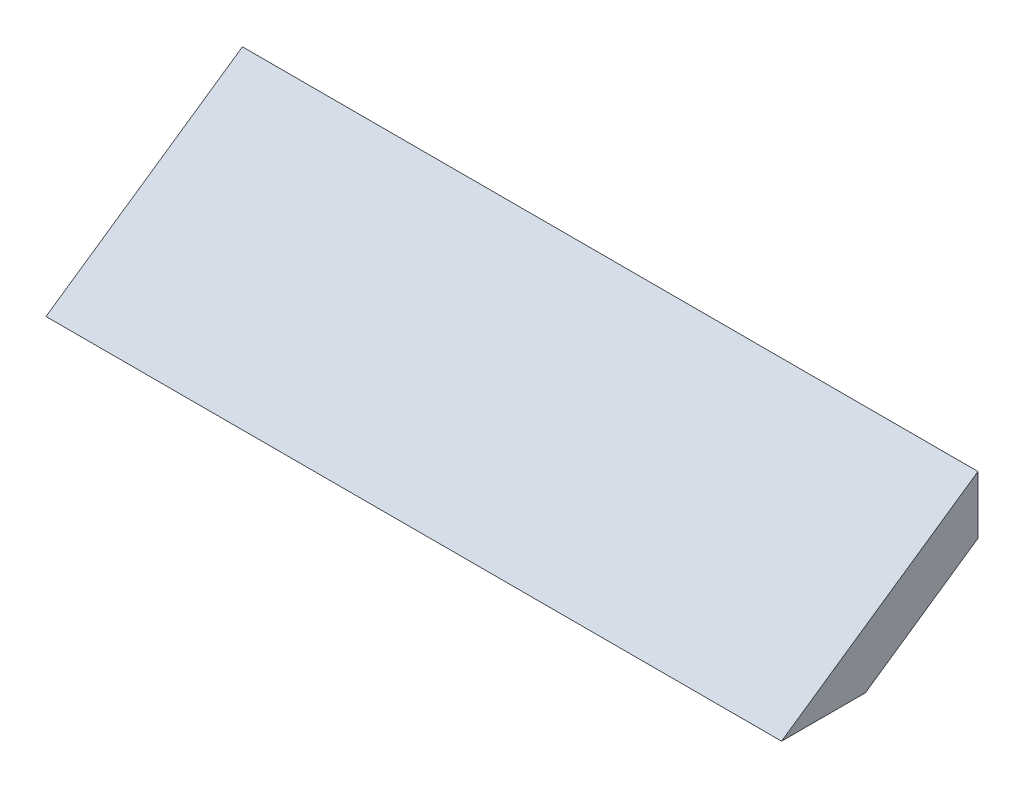
ISO-10303-21;
HEADER;
FILE_DESCRIPTION(('STEP AP214'),'2;1');
FILE_NAME('part.step','',(''),(''),'','','');
FILE_SCHEMA(('AUTOMOTIVE_DESIGN { 1 0 10303 214 1 1 1 1 }'));
ENDSEC;
DATA;
#1=APPLICATION_CONTEXT('core data for automotive mechanical design processes');
#2=APPLICATION_PROTOCOL_DEFINITION('international standard','automotive_design',2000,#1);
#3=PRODUCT_CONTEXT('',#1,'mechanical');
#4=PRODUCT('Part','Part','',(#3));
#5=PRODUCT_RELATED_PRODUCT_CATEGORY('part','',(#4));
#6=PRODUCT_DEFINITION_FORMATION('','',#4);
#7=PRODUCT_DEFINITION_CONTEXT('part definition',#1,'design');
#8=PRODUCT_DEFINITION('design','',#6,#7);
#9=PRODUCT_DEFINITION_SHAPE('','',#8);
#10=(LENGTH_UNIT() NAMED_UNIT(*) SI_UNIT(.MILLI.,.METRE.));
#11=(NAMED_UNIT(*) PLANE_ANGLE_UNIT() SI_UNIT($,.RADIAN.));
#12=(NAMED_UNIT(*) SI_UNIT($,.STERADIAN.) SOLID_ANGLE_UNIT());
#13=UNCERTAINTY_MEASURE_WITH_UNIT(LENGTH_MEASURE(1.E-05),#10,'distance_accuracy_value','');
#14=(GEOMETRIC_REPRESENTATION_CONTEXT(3) GLOBAL_UNCERTAINTY_ASSIGNED_CONTEXT((#13)) GLOBAL_UNIT_ASSIGNED_CONTEXT((#10,
#11,#12)) REPRESENTATION_CONTEXT('',''));
#15=CARTESIAN_POINT('',(0.,0.,0.));
#16=DIRECTION('',(0.,0.,1.));
#17=DIRECTION('',(1.,0.,0.));
#18=AXIS2_PLACEMENT_3D('',#15,#16,#17);
#19=CARTESIAN_POINT('',(700.,-55.,0.));
#20=DIRECTION('',(1.,0.,0.));
#21=DIRECTION('',(0.,0.,-1.));
#22=AXIS2_PLACEMENT_3D('',#19,#20,#21);
#23=PLANE('',#22);
#24=DIRECTION('',(0.,-0.567470144034264,0.823393973520411));
#25=VECTOR('',#24,1.);
#26=CARTESIAN_POINT('',(700.,55.,0.));
#27=LINE('',#26,#25);
#28=CARTESIAN_POINT('',(700.,55.,0.));
#29=VERTEX_POINT('',#28);
#30=CARTESIAN_POINT('',(700.,-202.635422446116,373.826634647951));
#31=VERTEX_POINT('',#30);
#32=EDGE_CURVE('E91',#29,#31,#27,.T.);
#33=ORIENTED_EDGE('',*,*,#32,.T.);
#34=DIRECTION('',(0.,0.,-1.));
#35=VECTOR('',#34,1.);
#36=CARTESIAN_POINT('',(700.,-202.635422446116,0.));
#37=LINE('',#36,#35);
#38=CARTESIAN_POINT('',(700.,-202.635422446116,214.217643691457));
#39=VERTEX_POINT('',#38);
#40=EDGE_CURVE('E84',#31,#39,#37,.T.);
#41=ORIENTED_EDGE('',*,*,#40,.T.);
#42=DIRECTION('',(0.,-0.567470144034264,0.823393973520411));
#43=VECTOR('',#42,1.);
#44=CARTESIAN_POINT('',(700.,-55.,0.));
#45=LINE('',#44,#43);
#46=CARTESIAN_POINT('',(700.,-55.,0.));
#47=VERTEX_POINT('',#46);
#48=EDGE_CURVE('E109',#47,#39,#45,.T.);
#49=ORIENTED_EDGE('',*,*,#48,.F.);
#50=DIRECTION('',(0.,1.,0.));
#51=VECTOR('',#50,1.);
#52=CARTESIAN_POINT('',(700.,-55.,0.));
#53=LINE('',#52,#51);
#54=EDGE_CURVE('E119',#47,#29,#53,.T.);
#55=ORIENTED_EDGE('',*,*,#54,.T.);
#56=EDGE_LOOP('',(#33,#41,#49,#55));
#57=FACE_BOUND('',#56,.T.);
#58=ADVANCED_FACE('F39',(#57),#23,.T.);
#59=CARTESIAN_POINT('',(-700.,-55.,0.));
#60=DIRECTION('',(0.,-0.823393973520411,-0.567470144034264));
#61=DIRECTION('',(0.,0.567470144034264,-0.823393973520411));
#62=AXIS2_PLACEMENT_3D('',#59,#60,#61);
#63=PLANE('',#62);
#64=DIRECTION('',(-1.,0.,0.));
#65=VECTOR('',#64,1.);
#66=CARTESIAN_POINT('',(-700.,-202.635422446116,214.217643691457));
#67=LINE('',#66,#65);
#68=CARTESIAN_POINT('',(-700.,-202.635422446116,214.217643691457));
#69=VERTEX_POINT('',#68);
#70=EDGE_CURVE('E11',#39,#69,#67,.T.);
#71=ORIENTED_EDGE('',*,*,#70,.T.);
#72=DIRECTION('',(0.,-0.567470144034264,0.823393973520411));
#73=VECTOR('',#72,1.);
#74=CARTESIAN_POINT('',(-700.,-55.,0.));
#75=LINE('',#74,#73);
#76=CARTESIAN_POINT('',(-700.,-55.,0.));
#77=VERTEX_POINT('',#76);
#78=EDGE_CURVE('E48',#77,#69,#75,.T.);
#79=ORIENTED_EDGE('',*,*,#78,.F.);
#80=DIRECTION('',(1.,0.,0.));
#81=VECTOR('',#80,1.);
#82=CARTESIAN_POINT('',(-700.,-55.,0.));
#83=LINE('',#82,#81);
#84=EDGE_CURVE('E55',#77,#47,#83,.T.);
#85=ORIENTED_EDGE('',*,*,#84,.T.);
#86=ORIENTED_EDGE('',*,*,#48,.T.);
#87=EDGE_LOOP('',(#71,#79,#85,#86));
#88=FACE_BOUND('',#87,.T.);
#89=ADVANCED_FACE('F126',(#88),#63,.T.);
#90=CARTESIAN_POINT('',(0.,0.,0.));
#91=DIRECTION('',(0.,0.,-1.));
#92=DIRECTION('',(-1.,0.,0.));
#93=AXIS2_PLACEMENT_3D('',#90,#91,#92);
#94=PLANE('',#93);
#95=ORIENTED_EDGE('',*,*,#54,.F.);
#96=ORIENTED_EDGE('',*,*,#84,.F.);
#97=DIRECTION('',(0.,-1.,0.));
#98=VECTOR('',#97,1.);
#99=CARTESIAN_POINT('',(-700.,-55.,0.));
#100=LINE('',#99,#98);
#101=CARTESIAN_POINT('',(-700.,55.,0.));
#102=VERTEX_POINT('',#101);
#103=EDGE_CURVE('E59',#102,#77,#100,.T.);
#104=ORIENTED_EDGE('',*,*,#103,.F.);
#105=DIRECTION('',(-1.,0.,0.));
#106=VECTOR('',#105,1.);
#107=CARTESIAN_POINT('',(-700.,55.,0.));
#108=LINE('',#107,#106);
#109=EDGE_CURVE('E100',#29,#102,#108,.T.);
#110=ORIENTED_EDGE('',*,*,#109,.F.);
#111=EDGE_LOOP('',(#95,#96,#104,#110));
#112=FACE_BOUND('',#111,.T.);
#113=ADVANCED_FACE('F41',(#112),#94,.T.);
#114=CARTESIAN_POINT('',(-700.,55.,0.));
#115=DIRECTION('',(0.,0.823393973520411,0.567470144034264));
#116=DIRECTION('',(0.,-0.567470144034264,0.823393973520411));
#117=AXIS2_PLACEMENT_3D('',#114,#115,#116);
#118=PLANE('',#117);
#119=DIRECTION('',(0.,-0.567470144034264,0.823393973520411));
#120=VECTOR('',#119,1.);
#121=CARTESIAN_POINT('',(-700.,55.,0.));
#122=LINE('',#121,#120);
#123=CARTESIAN_POINT('',(-700.,-202.635422446116,373.826634647951));
#124=VERTEX_POINT('',#123);
#125=EDGE_CURVE('E90',#102,#124,#122,.T.);
#126=ORIENTED_EDGE('',*,*,#125,.T.);
#127=DIRECTION('',(-1.,0.,0.));
#128=VECTOR('',#127,1.);
#129=CARTESIAN_POINT('',(-700.,-202.635422446116,373.826634647951));
#130=LINE('',#129,#128);
#131=EDGE_CURVE('E78',#31,#124,#130,.T.);
#132=ORIENTED_EDGE('',*,*,#131,.F.);
#133=ORIENTED_EDGE('',*,*,#32,.F.);
#134=ORIENTED_EDGE('',*,*,#109,.T.);
#135=EDGE_LOOP('',(#126,#132,#133,#134));
#136=FACE_BOUND('',#135,.T.);
#137=ADVANCED_FACE('F99',(#136),#118,.T.);
#138=CARTESIAN_POINT('',(-700.,-55.,0.));
#139=DIRECTION('',(-1.,0.,0.));
#140=DIRECTION('',(0.,0.,1.));
#141=AXIS2_PLACEMENT_3D('',#138,#139,#140);
#142=PLANE('',#141);
#143=DIRECTION('',(0.,0.,-1.));
#144=VECTOR('',#143,1.);
#145=CARTESIAN_POINT('',(-700.,-202.635422446116,0.));
#146=LINE('',#145,#144);
#147=EDGE_CURVE('E81',#124,#69,#146,.T.);
#148=ORIENTED_EDGE('',*,*,#147,.F.);
#149=ORIENTED_EDGE('',*,*,#125,.F.);
#150=ORIENTED_EDGE('',*,*,#103,.T.);
#151=ORIENTED_EDGE('',*,*,#78,.T.);
#152=EDGE_LOOP('',(#148,#149,#150,#151));
#153=FACE_BOUND('',#152,.T.);
#154=ADVANCED_FACE('F95',(#153),#142,.T.);
#155=CARTESIAN_POINT('',(3000.,-202.635422446116,373.826634647951));
#156=DIRECTION('',(0.,-1.,0.));
#157=DIRECTION('',(0.,0.,-1.));
#158=AXIS2_PLACEMENT_3D('',#155,#156,#157);
#159=PLANE('',#158);
#160=ORIENTED_EDGE('',*,*,#131,.T.);
#161=ORIENTED_EDGE('',*,*,#147,.T.);
#162=ORIENTED_EDGE('',*,*,#70,.F.);
#163=ORIENTED_EDGE('',*,*,#40,.F.);
#164=EDGE_LOOP('',(#160,#161,#162,#163));
#165=FACE_BOUND('',#164,.T.);
#166=ADVANCED_FACE('F80',(#165),#159,.T.);
#167=CLOSED_SHELL('',(#58,#89,#113,#137,#154,#166));
#168=MANIFOLD_SOLID_BREP('B2',#167);
#169=ADVANCED_BREP_SHAPE_REPRESENTATION('',(#18,#168),#14);
#170=SHAPE_DEFINITION_REPRESENTATION(#9,#169);
ENDSEC;
END-ISO-10303-21;
